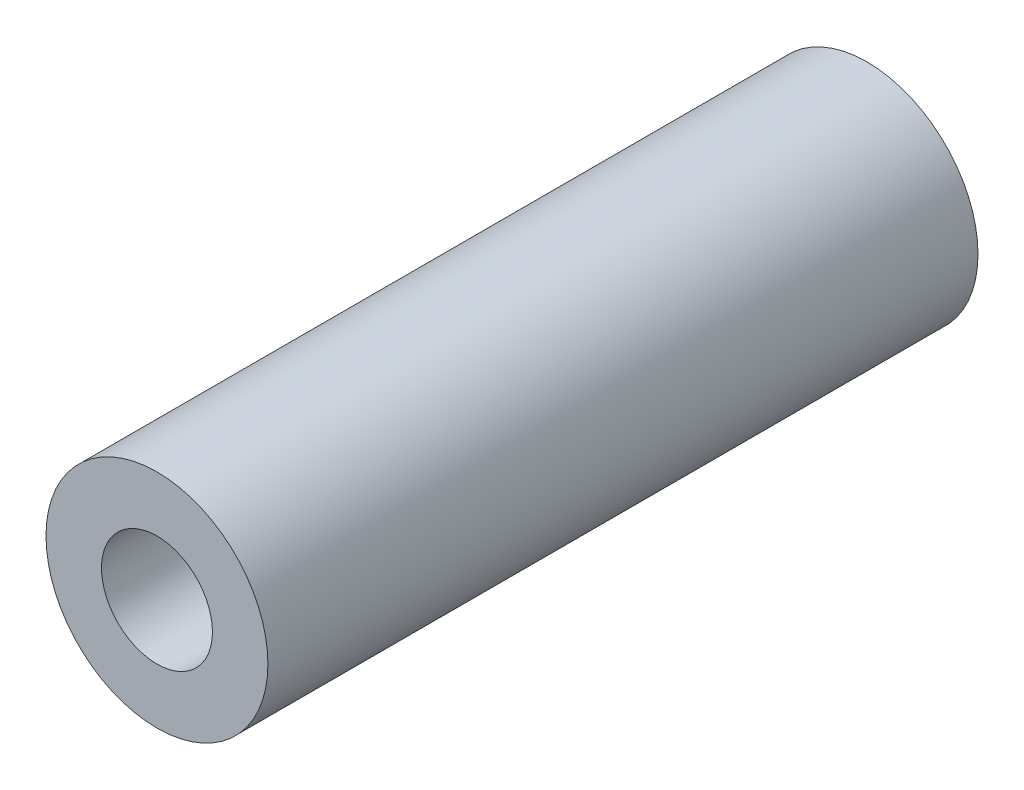
ISO-10303-21;
HEADER;
FILE_DESCRIPTION(('STEP AP214'),'2;1');
FILE_NAME('part.step','',(''),(''),'','','');
FILE_SCHEMA(('AUTOMOTIVE_DESIGN { 1 0 10303 214 1 1 1 1 }'));
ENDSEC;
DATA;
#1=APPLICATION_CONTEXT('core data for automotive mechanical design processes');
#2=APPLICATION_PROTOCOL_DEFINITION('international standard','automotive_design',2000,#1);
#3=PRODUCT_CONTEXT('',#1,'mechanical');
#4=PRODUCT('Part','Part','',(#3));
#5=PRODUCT_RELATED_PRODUCT_CATEGORY('part','',(#4));
#6=PRODUCT_DEFINITION_FORMATION('','',#4);
#7=PRODUCT_DEFINITION_CONTEXT('part definition',#1,'design');
#8=PRODUCT_DEFINITION('design','',#6,#7);
#9=PRODUCT_DEFINITION_SHAPE('','',#8);
#10=(LENGTH_UNIT() NAMED_UNIT(*) SI_UNIT(.MILLI.,.METRE.));
#11=(NAMED_UNIT(*) PLANE_ANGLE_UNIT() SI_UNIT($,.RADIAN.));
#12=(NAMED_UNIT(*) SI_UNIT($,.STERADIAN.) SOLID_ANGLE_UNIT());
#13=UNCERTAINTY_MEASURE_WITH_UNIT(LENGTH_MEASURE(1.E-05),#10,'distance_accuracy_value','');
#14=(GEOMETRIC_REPRESENTATION_CONTEXT(3) GLOBAL_UNCERTAINTY_ASSIGNED_CONTEXT((#13)) GLOBAL_UNIT_ASSIGNED_CONTEXT((#10,
#11,#12)) REPRESENTATION_CONTEXT('',''));
#15=CARTESIAN_POINT('',(0.,0.,0.));
#16=DIRECTION('',(0.,0.,1.));
#17=DIRECTION('',(1.,0.,0.));
#18=AXIS2_PLACEMENT_3D('',#15,#16,#17);
#19=CARTESIAN_POINT('',(0.,0.,16.));
#20=DIRECTION('',(0.,0.,1.));
#21=DIRECTION('',(1.,0.,0.));
#22=AXIS2_PLACEMENT_3D('',#19,#20,#21);
#23=PLANE('',#22);
#24=CARTESIAN_POINT('',(0.,0.,16.));
#25=DIRECTION('',(0.,0.,1.));
#26=DIRECTION('',(1.,0.,0.));
#27=AXIS2_PLACEMENT_3D('',#24,#25,#26);
#28=CIRCLE('',#27,2.5);
#29=CARTESIAN_POINT('',(2.5,0.,16.));
#30=VERTEX_POINT('',#29);
#31=EDGE_CURVE('E10',#30,#30,#28,.T.);
#32=ORIENTED_EDGE('',*,*,#31,.T.);
#33=EDGE_LOOP('',(#32));
#34=FACE_BOUND('',#33,.T.);
#35=CARTESIAN_POINT('',(0.,0.,16.));
#36=DIRECTION('',(0.,0.,1.));
#37=DIRECTION('',(1.,0.,0.));
#38=AXIS2_PLACEMENT_3D('',#35,#36,#37);
#39=CIRCLE('',#38,1.25);
#40=CARTESIAN_POINT('',(1.25,0.,16.));
#41=VERTEX_POINT('',#40);
#42=EDGE_CURVE('E45',#41,#41,#39,.T.);
#43=ORIENTED_EDGE('',*,*,#42,.F.);
#44=EDGE_LOOP('',(#43));
#45=FACE_BOUND('',#44,.T.);
#46=ADVANCED_FACE('F34',(#34,#45),#23,.T.);
#47=CARTESIAN_POINT('',(0.,0.,0.));
#48=DIRECTION('',(0.,0.,1.));
#49=DIRECTION('',(1.,0.,0.));
#50=AXIS2_PLACEMENT_3D('',#47,#48,#49);
#51=PLANE('',#50);
#52=CARTESIAN_POINT('',(0.,0.,0.));
#53=DIRECTION('',(0.,0.,1.));
#54=DIRECTION('',(1.,0.,0.));
#55=AXIS2_PLACEMENT_3D('',#52,#53,#54);
#56=CIRCLE('',#55,2.5);
#57=CARTESIAN_POINT('',(2.5,0.,0.));
#58=VERTEX_POINT('',#57);
#59=EDGE_CURVE('E38',#58,#58,#56,.T.);
#60=ORIENTED_EDGE('',*,*,#59,.F.);
#61=EDGE_LOOP('',(#60));
#62=FACE_BOUND('',#61,.T.);
#63=CARTESIAN_POINT('',(0.,0.,0.));
#64=DIRECTION('',(0.,0.,1.));
#65=DIRECTION('',(1.,0.,0.));
#66=AXIS2_PLACEMENT_3D('',#63,#64,#65);
#67=CIRCLE('',#66,1.25);
#68=CARTESIAN_POINT('',(1.25,0.,0.));
#69=VERTEX_POINT('',#68);
#70=EDGE_CURVE('E47',#69,#69,#67,.T.);
#71=ORIENTED_EDGE('',*,*,#70,.T.);
#72=EDGE_LOOP('',(#71));
#73=FACE_BOUND('',#72,.T.);
#74=ADVANCED_FACE('F57',(#62,#73),#51,.F.);
#75=CARTESIAN_POINT('',(0.,0.,16.));
#76=DIRECTION('',(0.,0.,-1.));
#77=DIRECTION('',(-1.,0.,0.));
#78=AXIS2_PLACEMENT_3D('',#75,#76,#77);
#79=CYLINDRICAL_SURFACE('',#78,2.5);
#80=ORIENTED_EDGE('',*,*,#31,.F.);
#81=EDGE_LOOP('',(#80));
#82=FACE_BOUND('',#81,.T.);
#83=ORIENTED_EDGE('',*,*,#59,.T.);
#84=EDGE_LOOP('',(#83));
#85=FACE_BOUND('',#84,.T.);
#86=ADVANCED_FACE('F36',(#82,#85),#79,.T.);
#87=CARTESIAN_POINT('',(0.,0.,16.));
#88=DIRECTION('',(0.,0.,-1.));
#89=DIRECTION('',(-1.,0.,0.));
#90=AXIS2_PLACEMENT_3D('',#87,#88,#89);
#91=CYLINDRICAL_SURFACE('',#90,1.25);
#92=ORIENTED_EDGE('',*,*,#42,.T.);
#93=EDGE_LOOP('',(#92));
#94=FACE_BOUND('',#93,.T.);
#95=ORIENTED_EDGE('',*,*,#70,.F.);
#96=EDGE_LOOP('',(#95));
#97=FACE_BOUND('',#96,.T.);
#98=ADVANCED_FACE('F53',(#94,#97),#91,.F.);
#99=CLOSED_SHELL('',(#46,#74,#86,#98));
#100=MANIFOLD_SOLID_BREP('B2',#99);
#101=ADVANCED_BREP_SHAPE_REPRESENTATION('',(#18,#100),#14);
#102=SHAPE_DEFINITION_REPRESENTATION(#9,#101);
ENDSEC;
END-ISO-10303-21;
